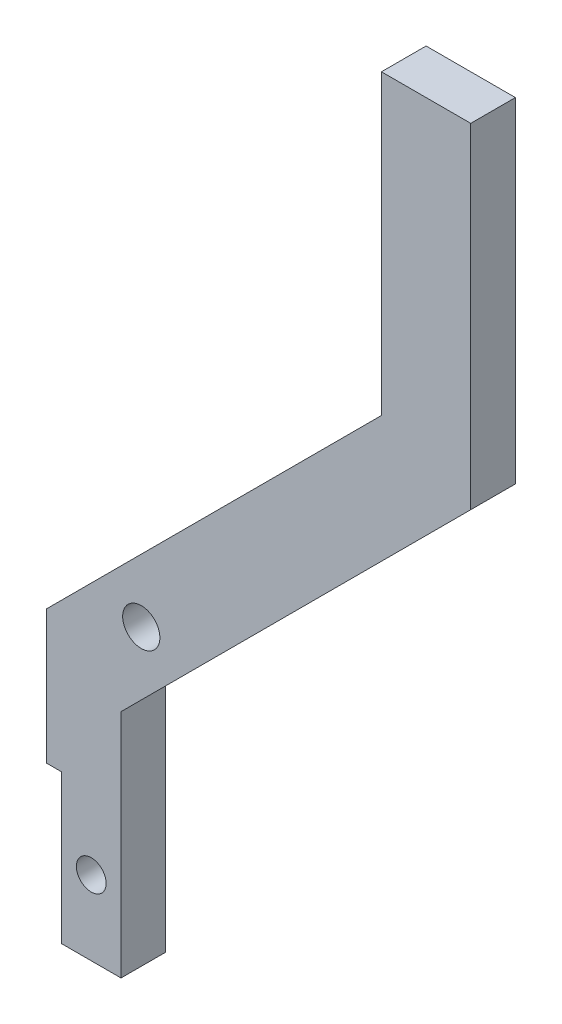
ISO-10303-21;
HEADER;
FILE_DESCRIPTION(('STEP AP214'),'2;1');
FILE_NAME('part.step','',(''),(''),'','','');
FILE_SCHEMA(('AUTOMOTIVE_DESIGN { 1 0 10303 214 1 1 1 1 }'));
ENDSEC;
DATA;
#1=APPLICATION_CONTEXT('core data for automotive mechanical design processes');
#2=APPLICATION_PROTOCOL_DEFINITION('international standard','automotive_design',2000,#1);
#3=PRODUCT_CONTEXT('',#1,'mechanical');
#4=PRODUCT('Part','Part','',(#3));
#5=PRODUCT_RELATED_PRODUCT_CATEGORY('part','',(#4));
#6=PRODUCT_DEFINITION_FORMATION('','',#4);
#7=PRODUCT_DEFINITION_CONTEXT('part definition',#1,'design');
#8=PRODUCT_DEFINITION('design','',#6,#7);
#9=PRODUCT_DEFINITION_SHAPE('','',#8);
#10=(LENGTH_UNIT() NAMED_UNIT(*) SI_UNIT(.MILLI.,.METRE.));
#11=(NAMED_UNIT(*) PLANE_ANGLE_UNIT() SI_UNIT($,.RADIAN.));
#12=(NAMED_UNIT(*) SI_UNIT($,.STERADIAN.) SOLID_ANGLE_UNIT());
#13=UNCERTAINTY_MEASURE_WITH_UNIT(LENGTH_MEASURE(1.E-05),#10,'distance_accuracy_value','');
#14=(GEOMETRIC_REPRESENTATION_CONTEXT(3) GLOBAL_UNCERTAINTY_ASSIGNED_CONTEXT((#13)) GLOBAL_UNIT_ASSIGNED_CONTEXT((#10,
#11,#12)) REPRESENTATION_CONTEXT('',''));
#15=CARTESIAN_POINT('',(0.,0.,0.));
#16=DIRECTION('',(0.,0.,1.));
#17=DIRECTION('',(1.,0.,0.));
#18=AXIS2_PLACEMENT_3D('',#15,#16,#17);
#19=CARTESIAN_POINT('',(-29.1839757811056,-29.9691948604178,3.));
#20=DIRECTION('',(0.,1.,0.));
#21=DIRECTION('',(0.,0.,1.));
#22=AXIS2_PLACEMENT_3D('',#19,#20,#21);
#23=PLANE('',#22);
#24=DIRECTION('',(1.,0.,0.));
#25=VECTOR('',#24,1.);
#26=CARTESIAN_POINT('',(-29.1839757811056,-29.9691948604178,3.));
#27=LINE('',#26,#25);
#28=CARTESIAN_POINT('',(-33.1839757811056,-29.9691948604178,3.));
#29=VERTEX_POINT('',#28);
#30=CARTESIAN_POINT('',(-29.1839757811056,-29.9691948604178,3.));
#31=VERTEX_POINT('',#30);
#32=EDGE_CURVE('E136',#29,#31,#27,.T.);
#33=ORIENTED_EDGE('',*,*,#32,.F.);
#34=DIRECTION('',(0.,0.,1.));
#35=VECTOR('',#34,1.);
#36=CARTESIAN_POINT('',(-33.1839757811056,-29.9691948604178,0.));
#37=LINE('',#36,#35);
#38=CARTESIAN_POINT('',(-33.1839757811056,-29.9691948604178,0.));
#39=VERTEX_POINT('',#38);
#40=EDGE_CURVE('E134',#39,#29,#37,.T.);
#41=ORIENTED_EDGE('',*,*,#40,.F.);
#42=DIRECTION('',(1.,0.,0.));
#43=VECTOR('',#42,1.);
#44=CARTESIAN_POINT('',(-29.1839757811056,-29.9691948604178,0.));
#45=LINE('',#44,#43);
#46=CARTESIAN_POINT('',(-29.1839757811056,-29.9691948604178,0.));
#47=VERTEX_POINT('',#46);
#48=EDGE_CURVE('E133',#39,#47,#45,.T.);
#49=ORIENTED_EDGE('',*,*,#48,.T.);
#50=DIRECTION('',(0.,0.,-1.));
#51=VECTOR('',#50,1.);
#52=CARTESIAN_POINT('',(-29.1839757811056,-29.9691948604178,3.));
#53=LINE('',#52,#51);
#54=EDGE_CURVE('E40',#31,#47,#53,.T.);
#55=ORIENTED_EDGE('',*,*,#54,.F.);
#56=EDGE_LOOP('',(#33,#41,#49,#55));
#57=FACE_BOUND('',#56,.T.);
#58=ADVANCED_FACE('F32',(#57),#23,.F.);
#59=CARTESIAN_POINT('',(-29.1839757811056,-29.9691948604178,3.));
#60=DIRECTION('',(-1.,0.,0.));
#61=DIRECTION('',(0.,-1.,0.));
#62=AXIS2_PLACEMENT_3D('',#59,#60,#61);
#63=PLANE('',#62);
#64=DIRECTION('',(0.,1.,0.));
#65=VECTOR('',#64,1.);
#66=CARTESIAN_POINT('',(-29.1839757811056,-29.9691948604178,0.));
#67=LINE('',#66,#65);
#68=CARTESIAN_POINT('',(-29.1839757811056,-14.4691948604178,0.));
#69=VERTEX_POINT('',#68);
#70=EDGE_CURVE('E152',#47,#69,#67,.T.);
#71=ORIENTED_EDGE('',*,*,#70,.T.);
#72=DIRECTION('',(0.,0.,-1.));
#73=VECTOR('',#72,1.);
#74=CARTESIAN_POINT('',(-29.1839757811056,-14.4691948604178,3.));
#75=LINE('',#74,#73);
#76=CARTESIAN_POINT('',(-29.1839757811056,-14.4691948604178,3.));
#77=VERTEX_POINT('',#76);
#78=EDGE_CURVE('E175',#77,#69,#75,.T.);
#79=ORIENTED_EDGE('',*,*,#78,.F.);
#80=DIRECTION('',(0.,1.,0.));
#81=VECTOR('',#80,1.);
#82=CARTESIAN_POINT('',(-29.1839757811056,-29.9691948604178,3.));
#83=LINE('',#82,#81);
#84=EDGE_CURVE('E138',#31,#77,#83,.T.);
#85=ORIENTED_EDGE('',*,*,#84,.F.);
#86=ORIENTED_EDGE('',*,*,#54,.T.);
#87=EDGE_LOOP('',(#71,#79,#85,#86));
#88=FACE_BOUND('',#87,.T.);
#89=ADVANCED_FACE('F182',(#88),#63,.F.);
#90=CARTESIAN_POINT('',(-29.1839757811056,-14.4691948604178,3.));
#91=DIRECTION('',(-0.707106781186544,0.707106781186551,0.));
#92=DIRECTION('',(-0.707106781186551,-0.707106781186544,0.));
#93=AXIS2_PLACEMENT_3D('',#90,#91,#92);
#94=PLANE('',#93);
#95=DIRECTION('',(0.707106781186551,0.707106781186544,0.));
#96=VECTOR('',#95,1.);
#97=CARTESIAN_POINT('',(-29.1839757811056,-14.4691948604178,0.));
#98=LINE('',#97,#96);
#99=CARTESIAN_POINT('',(-5.68397578110556,9.03080513958194,0.));
#100=VERTEX_POINT('',#99);
#101=EDGE_CURVE('E154',#69,#100,#98,.T.);
#102=ORIENTED_EDGE('',*,*,#101,.T.);
#103=DIRECTION('',(0.,0.,-1.));
#104=VECTOR('',#103,1.);
#105=CARTESIAN_POINT('',(-5.68397578110556,9.03080513958194,3.));
#106=LINE('',#105,#104);
#107=CARTESIAN_POINT('',(-5.68397578110556,9.03080513958194,3.));
#108=VERTEX_POINT('',#107);
#109=EDGE_CURVE('E172',#108,#100,#106,.T.);
#110=ORIENTED_EDGE('',*,*,#109,.F.);
#111=DIRECTION('',(0.707106781186551,0.707106781186544,0.));
#112=VECTOR('',#111,1.);
#113=CARTESIAN_POINT('',(-29.1839757811056,-14.4691948604178,3.));
#114=LINE('',#113,#112);
#115=EDGE_CURVE('E141',#77,#108,#114,.T.);
#116=ORIENTED_EDGE('',*,*,#115,.F.);
#117=ORIENTED_EDGE('',*,*,#78,.T.);
#118=EDGE_LOOP('',(#102,#110,#116,#117));
#119=FACE_BOUND('',#118,.T.);
#120=ADVANCED_FACE('F196',(#119),#94,.F.);
#121=CARTESIAN_POINT('',(-5.68397578110557,31.5160865138205,3.));
#122=DIRECTION('',(-1.,0.,0.));
#123=DIRECTION('',(0.,-1.,0.));
#124=AXIS2_PLACEMENT_3D('',#121,#122,#123);
#125=PLANE('',#124);
#126=DIRECTION('',(0.,1.,0.));
#127=VECTOR('',#126,1.);
#128=CARTESIAN_POINT('',(-5.68397578110557,31.5160865138205,0.));
#129=LINE('',#128,#127);
#130=CARTESIAN_POINT('',(-5.68397578110557,31.5160865138205,0.));
#131=VERTEX_POINT('',#130);
#132=EDGE_CURVE('E156',#100,#131,#129,.T.);
#133=ORIENTED_EDGE('',*,*,#132,.T.);
#134=DIRECTION('',(0.,0.,-1.));
#135=VECTOR('',#134,1.);
#136=CARTESIAN_POINT('',(-5.68397578110557,31.5160865138205,3.));
#137=LINE('',#136,#135);
#138=CARTESIAN_POINT('',(-5.68397578110557,31.5160865138205,3.));
#139=VERTEX_POINT('',#138);
#140=EDGE_CURVE('E169',#139,#131,#137,.T.);
#141=ORIENTED_EDGE('',*,*,#140,.F.);
#142=DIRECTION('',(0.,1.,0.));
#143=VECTOR('',#142,1.);
#144=CARTESIAN_POINT('',(-5.68397578110557,31.5160865138205,3.));
#145=LINE('',#144,#143);
#146=EDGE_CURVE('E143',#108,#139,#145,.T.);
#147=ORIENTED_EDGE('',*,*,#146,.F.);
#148=ORIENTED_EDGE('',*,*,#109,.T.);
#149=EDGE_LOOP('',(#133,#141,#147,#148));
#150=FACE_BOUND('',#149,.T.);
#151=ADVANCED_FACE('F200',(#150),#125,.F.);
#152=CARTESIAN_POINT('',(-11.6839757811056,31.5160865138205,3.));
#153=DIRECTION('',(0.,-1.,0.));
#154=DIRECTION('',(0.,0.,-1.));
#155=AXIS2_PLACEMENT_3D('',#152,#153,#154);
#156=PLANE('',#155);
#157=DIRECTION('',(-1.,0.,0.));
#158=VECTOR('',#157,1.);
#159=CARTESIAN_POINT('',(-11.6839757811056,31.5160865138205,0.));
#160=LINE('',#159,#158);
#161=CARTESIAN_POINT('',(-11.6839757811056,31.5160865138205,0.));
#162=VERTEX_POINT('',#161);
#163=EDGE_CURVE('E158',#131,#162,#160,.T.);
#164=ORIENTED_EDGE('',*,*,#163,.T.);
#165=DIRECTION('',(0.,0.,-1.));
#166=VECTOR('',#165,1.);
#167=CARTESIAN_POINT('',(-11.6839757811056,31.5160865138205,3.));
#168=LINE('',#167,#166);
#169=CARTESIAN_POINT('',(-11.6839757811056,31.5160865138205,3.));
#170=VERTEX_POINT('',#169);
#171=EDGE_CURVE('E166',#170,#162,#168,.T.);
#172=ORIENTED_EDGE('',*,*,#171,.F.);
#173=DIRECTION('',(-1.,0.,0.));
#174=VECTOR('',#173,1.);
#175=CARTESIAN_POINT('',(-11.6839757811056,31.5160865138205,3.));
#176=LINE('',#175,#174);
#177=EDGE_CURVE('E145',#139,#170,#176,.T.);
#178=ORIENTED_EDGE('',*,*,#177,.F.);
#179=ORIENTED_EDGE('',*,*,#140,.T.);
#180=EDGE_LOOP('',(#164,#172,#178,#179));
#181=FACE_BOUND('',#180,.T.);
#182=ADVANCED_FACE('F257',(#181),#156,.F.);
#183=CARTESIAN_POINT('',(-11.6839757811056,11.5160865138205,3.));
#184=DIRECTION('',(1.,0.,0.));
#185=DIRECTION('',(0.,0.,-1.));
#186=AXIS2_PLACEMENT_3D('',#183,#184,#185);
#187=PLANE('',#186);
#188=DIRECTION('',(0.,-1.,0.));
#189=VECTOR('',#188,1.);
#190=CARTESIAN_POINT('',(-11.6839757811056,11.5160865138205,0.));
#191=LINE('',#190,#189);
#192=CARTESIAN_POINT('',(-11.6839757811056,11.5160865138205,0.));
#193=VERTEX_POINT('',#192);
#194=EDGE_CURVE('E160',#162,#193,#191,.T.);
#195=ORIENTED_EDGE('',*,*,#194,.T.);
#196=DIRECTION('',(0.,0.,-1.));
#197=VECTOR('',#196,1.);
#198=CARTESIAN_POINT('',(-11.6839757811056,11.5160865138205,3.));
#199=LINE('',#198,#197);
#200=CARTESIAN_POINT('',(-11.6839757811056,11.5160865138205,3.));
#201=VERTEX_POINT('',#200);
#202=EDGE_CURVE('E150',#201,#193,#199,.T.);
#203=ORIENTED_EDGE('',*,*,#202,.F.);
#204=DIRECTION('',(0.,-1.,0.));
#205=VECTOR('',#204,1.);
#206=CARTESIAN_POINT('',(-11.6839757811056,11.5160865138205,3.));
#207=LINE('',#206,#205);
#208=EDGE_CURVE('E147',#170,#201,#207,.T.);
#209=ORIENTED_EDGE('',*,*,#208,.F.);
#210=ORIENTED_EDGE('',*,*,#171,.T.);
#211=EDGE_LOOP('',(#195,#203,#209,#210));
#212=FACE_BOUND('',#211,.T.);
#213=ADVANCED_FACE('F242',(#212),#187,.F.);
#214=CARTESIAN_POINT('',(-11.6839757811056,11.5160865138205,3.));
#215=DIRECTION('',(0.707106781186544,-0.707106781186551,0.));
#216=DIRECTION('',(0.707106781186551,0.707106781186544,0.));
#217=AXIS2_PLACEMENT_3D('',#214,#215,#216);
#218=PLANE('',#217);
#219=DIRECTION('',(-0.707106781186551,-0.707106781186544,0.));
#220=VECTOR('',#219,1.);
#221=CARTESIAN_POINT('',(-11.6839757811056,11.5160865138205,0.));
#222=LINE('',#221,#220);
#223=CARTESIAN_POINT('',(-34.1839757811056,-10.9839134861792,0.));
#224=VERTEX_POINT('',#223);
#225=EDGE_CURVE('E139',#193,#224,#222,.T.);
#226=ORIENTED_EDGE('',*,*,#225,.T.);
#227=DIRECTION('',(0.,0.,1.));
#228=VECTOR('',#227,1.);
#229=CARTESIAN_POINT('',(-34.1839757811056,-10.9839134861792,3.));
#230=LINE('',#229,#228);
#231=CARTESIAN_POINT('',(-34.1839757811056,-10.9839134861792,3.));
#232=VERTEX_POINT('',#231);
#233=EDGE_CURVE('E128',#224,#232,#230,.T.);
#234=ORIENTED_EDGE('',*,*,#233,.T.);
#235=DIRECTION('',(-0.707106781186551,-0.707106781186544,0.));
#236=VECTOR('',#235,1.);
#237=CARTESIAN_POINT('',(-11.6839757811056,11.5160865138205,3.));
#238=LINE('',#237,#236);
#239=EDGE_CURVE('E117',#201,#232,#238,.T.);
#240=ORIENTED_EDGE('',*,*,#239,.F.);
#241=ORIENTED_EDGE('',*,*,#202,.T.);
#242=EDGE_LOOP('',(#226,#234,#240,#241));
#243=FACE_BOUND('',#242,.T.);
#244=ADVANCED_FACE('F236',(#243),#218,.F.);
#245=CARTESIAN_POINT('',(0.,0.,3.));
#246=DIRECTION('',(0.,0.,-1.));
#247=DIRECTION('',(-1.,0.,0.));
#248=AXIS2_PLACEMENT_3D('',#245,#246,#247);
#249=PLANE('',#248);
#250=CARTESIAN_POINT('',(-31.1839757811056,-24.9691948604178,3.));
#251=DIRECTION('',(0.,0.,1.));
#252=DIRECTION('',(1.,0.,0.));
#253=AXIS2_PLACEMENT_3D('',#250,#251,#252);
#254=CIRCLE('',#253,1.);
#255=CARTESIAN_POINT('',(-30.1839757811056,-24.9691948604178,3.));
#256=VERTEX_POINT('',#255);
#257=EDGE_CURVE('E215',#256,#256,#254,.T.);
#258=ORIENTED_EDGE('',*,*,#257,.F.);
#259=EDGE_LOOP('',(#258));
#260=FACE_BOUND('',#259,.T.);
#261=CARTESIAN_POINT('',(-27.8239757811056,-8.86655417329875,3.));
#262=DIRECTION('',(0.,0.,1.));
#263=DIRECTION('',(1.,0.,0.));
#264=AXIS2_PLACEMENT_3D('',#261,#262,#263);
#265=CIRCLE('',#264,1.25);
#266=CARTESIAN_POINT('',(-26.5739757811056,-8.86655417329875,3.));
#267=VERTEX_POINT('',#266);
#268=EDGE_CURVE('E210',#267,#267,#265,.T.);
#269=ORIENTED_EDGE('',*,*,#268,.F.);
#270=EDGE_LOOP('',(#269));
#271=FACE_BOUND('',#270,.T.);
#272=ORIENTED_EDGE('',*,*,#239,.T.);
#273=DIRECTION('',(0.,1.,0.));
#274=VECTOR('',#273,1.);
#275=CARTESIAN_POINT('',(-34.1839757811056,-19.9691948604178,3.));
#276=LINE('',#275,#274);
#277=CARTESIAN_POINT('',(-34.1839757811056,-19.9691948604178,3.));
#278=VERTEX_POINT('',#277);
#279=EDGE_CURVE('E107',#278,#232,#276,.T.);
#280=ORIENTED_EDGE('',*,*,#279,.F.);
#281=DIRECTION('',(-1.,0.,0.));
#282=VECTOR('',#281,1.);
#283=CARTESIAN_POINT('',(-35.1839757811056,-19.9691948604178,3.));
#284=LINE('',#283,#282);
#285=CARTESIAN_POINT('',(-33.1839757811056,-19.9691948604178,3.));
#286=VERTEX_POINT('',#285);
#287=EDGE_CURVE('E115',#286,#278,#284,.T.);
#288=ORIENTED_EDGE('',*,*,#287,.F.);
#289=DIRECTION('',(0.,1.,0.));
#290=VECTOR('',#289,1.);
#291=CARTESIAN_POINT('',(-33.1839757811056,-29.9691948604178,3.));
#292=LINE('',#291,#290);
#293=EDGE_CURVE('E124',#29,#286,#292,.T.);
#294=ORIENTED_EDGE('',*,*,#293,.F.);
#295=ORIENTED_EDGE('',*,*,#32,.T.);
#296=ORIENTED_EDGE('',*,*,#84,.T.);
#297=ORIENTED_EDGE('',*,*,#115,.T.);
#298=ORIENTED_EDGE('',*,*,#146,.T.);
#299=ORIENTED_EDGE('',*,*,#177,.T.);
#300=ORIENTED_EDGE('',*,*,#208,.T.);
#301=EDGE_LOOP('',(#272,#280,#288,#294,#295,#296,#297,#298,#299,#300));
#302=FACE_BOUND('',#301,.T.);
#303=ADVANCED_FACE('F113',(#260,#271,#302),#249,.F.);
#304=CARTESIAN_POINT('',(0.,0.,0.));
#305=DIRECTION('',(0.,0.,-1.));
#306=DIRECTION('',(-1.,0.,0.));
#307=AXIS2_PLACEMENT_3D('',#304,#305,#306);
#308=PLANE('',#307);
#309=CARTESIAN_POINT('',(-31.1839757811056,-24.9691948604178,0.));
#310=DIRECTION('',(0.,0.,-1.));
#311=DIRECTION('',(-1.,0.,0.));
#312=AXIS2_PLACEMENT_3D('',#309,#310,#311);
#313=CIRCLE('',#312,1.);
#314=CARTESIAN_POINT('',(-32.1839757811056,-24.9691948604178,0.));
#315=VERTEX_POINT('',#314);
#316=EDGE_CURVE('E35',#315,#315,#313,.T.);
#317=ORIENTED_EDGE('',*,*,#316,.F.);
#318=EDGE_LOOP('',(#317));
#319=FACE_BOUND('',#318,.T.);
#320=CARTESIAN_POINT('',(-27.8239757811056,-8.86655417329875,0.));
#321=DIRECTION('',(0.,0.,1.));
#322=DIRECTION('',(1.,0.,0.));
#323=AXIS2_PLACEMENT_3D('',#320,#321,#322);
#324=CIRCLE('',#323,1.25);
#325=CARTESIAN_POINT('',(-26.5739757811056,-8.86655417329875,0.));
#326=VERTEX_POINT('',#325);
#327=EDGE_CURVE('E118',#326,#326,#324,.T.);
#328=ORIENTED_EDGE('',*,*,#327,.T.);
#329=EDGE_LOOP('',(#328));
#330=FACE_BOUND('',#329,.T.);
#331=DIRECTION('',(0.,-1.,0.));
#332=VECTOR('',#331,1.);
#333=CARTESIAN_POINT('',(-34.1839757811056,0.,0.));
#334=LINE('',#333,#332);
#335=CARTESIAN_POINT('',(-34.1839757811056,-19.9691948604178,0.));
#336=VERTEX_POINT('',#335);
#337=EDGE_CURVE('E47',#224,#336,#334,.T.);
#338=ORIENTED_EDGE('',*,*,#337,.F.);
#339=ORIENTED_EDGE('',*,*,#225,.F.);
#340=ORIENTED_EDGE('',*,*,#194,.F.);
#341=ORIENTED_EDGE('',*,*,#163,.F.);
#342=ORIENTED_EDGE('',*,*,#132,.F.);
#343=ORIENTED_EDGE('',*,*,#101,.F.);
#344=ORIENTED_EDGE('',*,*,#70,.F.);
#345=ORIENTED_EDGE('',*,*,#48,.F.);
#346=DIRECTION('',(0.,1.,0.));
#347=VECTOR('',#346,1.);
#348=CARTESIAN_POINT('',(-33.1839757811056,-29.9691948604178,0.));
#349=LINE('',#348,#347);
#350=CARTESIAN_POINT('',(-33.1839757811056,-19.9691948604178,0.));
#351=VERTEX_POINT('',#350);
#352=EDGE_CURVE('E123',#39,#351,#349,.T.);
#353=ORIENTED_EDGE('',*,*,#352,.T.);
#354=DIRECTION('',(-1.,0.,0.));
#355=VECTOR('',#354,1.);
#356=CARTESIAN_POINT('',(-35.1839757811056,-19.9691948604178,0.));
#357=LINE('',#356,#355);
#358=EDGE_CURVE('E53',#351,#336,#357,.T.);
#359=ORIENTED_EDGE('',*,*,#358,.T.);
#360=EDGE_LOOP('',(#338,#339,#340,#341,#342,#343,#344,#345,#353,#359));
#361=FACE_BOUND('',#360,.T.);
#362=ADVANCED_FACE('F191',(#319,#330,#361),#308,.T.);
#363=CARTESIAN_POINT('',(-35.1839757811056,-19.9691948604178,0.));
#364=DIRECTION('',(0.,1.,0.));
#365=DIRECTION('',(0.,0.,1.));
#366=AXIS2_PLACEMENT_3D('',#363,#364,#365);
#367=PLANE('',#366);
#368=ORIENTED_EDGE('',*,*,#287,.T.);
#369=DIRECTION('',(0.,0.,-1.));
#370=VECTOR('',#369,1.);
#371=CARTESIAN_POINT('',(-34.1839757811056,-19.9691948604178,0.));
#372=LINE('',#371,#370);
#373=EDGE_CURVE('E11',#278,#336,#372,.T.);
#374=ORIENTED_EDGE('',*,*,#373,.T.);
#375=ORIENTED_EDGE('',*,*,#358,.F.);
#376=DIRECTION('',(0.,0.,1.));
#377=VECTOR('',#376,1.);
#378=CARTESIAN_POINT('',(-33.1839757811056,-19.9691948604178,0.));
#379=LINE('',#378,#377);
#380=EDGE_CURVE('E121',#351,#286,#379,.T.);
#381=ORIENTED_EDGE('',*,*,#380,.T.);
#382=EDGE_LOOP('',(#368,#374,#375,#381));
#383=FACE_BOUND('',#382,.T.);
#384=ADVANCED_FACE('F120',(#383),#367,.F.);
#385=CARTESIAN_POINT('',(-33.1839757811056,-29.9691948604178,0.));
#386=DIRECTION('',(1.,0.,0.));
#387=DIRECTION('',(0.,0.,-1.));
#388=AXIS2_PLACEMENT_3D('',#385,#386,#387);
#389=PLANE('',#388);
#390=ORIENTED_EDGE('',*,*,#293,.T.);
#391=ORIENTED_EDGE('',*,*,#380,.F.);
#392=ORIENTED_EDGE('',*,*,#352,.F.);
#393=ORIENTED_EDGE('',*,*,#40,.T.);
#394=EDGE_LOOP('',(#390,#391,#392,#393));
#395=FACE_BOUND('',#394,.T.);
#396=ADVANCED_FACE('F205',(#395),#389,.F.);
#397=CARTESIAN_POINT('',(-34.1839757811056,-19.9691948604178,-7.));
#398=DIRECTION('',(1.,0.,0.));
#399=DIRECTION('',(0.,0.,-1.));
#400=AXIS2_PLACEMENT_3D('',#397,#398,#399);
#401=PLANE('',#400);
#402=ORIENTED_EDGE('',*,*,#337,.T.);
#403=ORIENTED_EDGE('',*,*,#373,.F.);
#404=ORIENTED_EDGE('',*,*,#279,.T.);
#405=ORIENTED_EDGE('',*,*,#233,.F.);
#406=EDGE_LOOP('',(#402,#403,#404,#405));
#407=FACE_BOUND('',#406,.T.);
#408=ADVANCED_FACE('F106',(#407),#401,.F.);
#409=CARTESIAN_POINT('',(-27.8239757811056,-8.86655417329875,0.));
#410=DIRECTION('',(0.,0.,1.));
#411=DIRECTION('',(1.,0.,0.));
#412=AXIS2_PLACEMENT_3D('',#409,#410,#411);
#413=CYLINDRICAL_SURFACE('',#412,1.25);
#414=ORIENTED_EDGE('',*,*,#327,.F.);
#415=EDGE_LOOP('',(#414));
#416=FACE_BOUND('',#415,.T.);
#417=ORIENTED_EDGE('',*,*,#268,.T.);
#418=EDGE_LOOP('',(#417));
#419=FACE_BOUND('',#418,.T.);
#420=ADVANCED_FACE('F229',(#416,#419),#413,.F.);
#421=CARTESIAN_POINT('',(-31.1839757811056,-24.9691948604178,-7.));
#422=DIRECTION('',(0.,0.,1.));
#423=DIRECTION('',(1.,0.,0.));
#424=AXIS2_PLACEMENT_3D('',#421,#422,#423);
#425=CYLINDRICAL_SURFACE('',#424,1.);
#426=ORIENTED_EDGE('',*,*,#316,.T.);
#427=EDGE_LOOP('',(#426));
#428=FACE_BOUND('',#427,.T.);
#429=ORIENTED_EDGE('',*,*,#257,.T.);
#430=EDGE_LOOP('',(#429));
#431=FACE_BOUND('',#430,.T.);
#432=ADVANCED_FACE('F222',(#428,#431),#425,.F.);
#433=CLOSED_SHELL('',(#58,#89,#120,#151,#182,#213,#244,#303,#362,#384,#396,#408,#420,#432));
#434=MANIFOLD_SOLID_BREP('B2',#433);
#435=ADVANCED_BREP_SHAPE_REPRESENTATION('',(#18,#434),#14);
#436=SHAPE_DEFINITION_REPRESENTATION(#9,#435);
ENDSEC;
END-ISO-10303-21;
